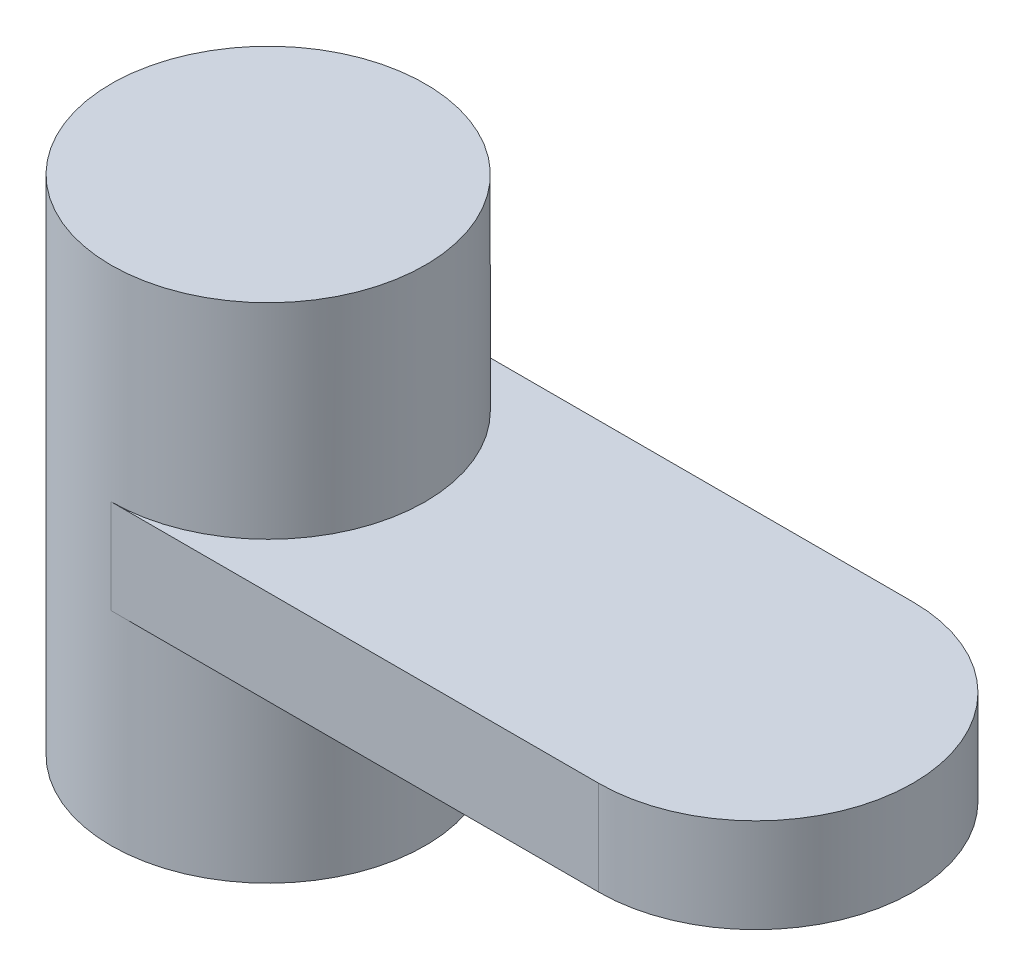
ISO-10303-21;
HEADER;
FILE_DESCRIPTION(('STEP AP214'),'2;1');
FILE_NAME('part.step','',(''),(''),'','','');
FILE_SCHEMA(('AUTOMOTIVE_DESIGN { 1 0 10303 214 1 1 1 1 }'));
ENDSEC;
DATA;
#1=APPLICATION_CONTEXT('core data for automotive mechanical design processes');
#2=APPLICATION_PROTOCOL_DEFINITION('international standard','automotive_design',2000,#1);
#3=PRODUCT_CONTEXT('',#1,'mechanical');
#4=PRODUCT('Part','Part','',(#3));
#5=PRODUCT_RELATED_PRODUCT_CATEGORY('part','',(#4));
#6=PRODUCT_DEFINITION_FORMATION('','',#4);
#7=PRODUCT_DEFINITION_CONTEXT('part definition',#1,'design');
#8=PRODUCT_DEFINITION('design','',#6,#7);
#9=PRODUCT_DEFINITION_SHAPE('','',#8);
#10=(LENGTH_UNIT() NAMED_UNIT(*) SI_UNIT(.MILLI.,.METRE.));
#11=(NAMED_UNIT(*) PLANE_ANGLE_UNIT() SI_UNIT($,.RADIAN.));
#12=(NAMED_UNIT(*) SI_UNIT($,.STERADIAN.) SOLID_ANGLE_UNIT());
#13=UNCERTAINTY_MEASURE_WITH_UNIT(LENGTH_MEASURE(1.E-05),#10,'distance_accuracy_value','');
#14=(GEOMETRIC_REPRESENTATION_CONTEXT(3) GLOBAL_UNCERTAINTY_ASSIGNED_CONTEXT((#13)) GLOBAL_UNIT_ASSIGNED_CONTEXT((#10,
#11,#12)) REPRESENTATION_CONTEXT('',''));
#15=CARTESIAN_POINT('',(0.,0.,0.));
#16=DIRECTION('',(0.,0.,1.));
#17=DIRECTION('',(1.,0.,0.));
#18=AXIS2_PLACEMENT_3D('',#15,#16,#17);
#19=CARTESIAN_POINT('',(49.276,19.05,0.));
#20=DIRECTION('',(0.,-1.,0.));
#21=DIRECTION('',(0.,0.,-1.));
#22=AXIS2_PLACEMENT_3D('',#19,#20,#21);
#23=CYLINDRICAL_SURFACE('',#22,31.75);
#24=CARTESIAN_POINT('',(49.276,0.,0.));
#25=DIRECTION('',(0.,1.,0.));
#26=DIRECTION('',(0.,0.,1.));
#27=AXIS2_PLACEMENT_3D('',#24,#25,#26);
#28=CIRCLE('',#27,31.75);
#29=CARTESIAN_POINT('',(49.276,0.,31.75));
#30=VERTEX_POINT('',#29);
#31=CARTESIAN_POINT('',(49.276,0.,-31.75));
#32=VERTEX_POINT('',#31);
#33=EDGE_CURVE('E92',#30,#32,#28,.T.);
#34=ORIENTED_EDGE('',*,*,#33,.T.);
#35=DIRECTION('',(0.,-1.,0.));
#36=VECTOR('',#35,1.);
#37=CARTESIAN_POINT('',(49.276,19.05,-31.75));
#38=LINE('',#37,#36);
#39=CARTESIAN_POINT('',(49.276,19.05,-31.75));
#40=VERTEX_POINT('',#39);
#41=EDGE_CURVE('E45',#40,#32,#38,.T.);
#42=ORIENTED_EDGE('',*,*,#41,.F.);
#43=CARTESIAN_POINT('',(49.276,19.05,0.));
#44=DIRECTION('',(0.,1.,0.));
#45=DIRECTION('',(0.,0.,1.));
#46=AXIS2_PLACEMENT_3D('',#43,#44,#45);
#47=CIRCLE('',#46,31.75);
#48=CARTESIAN_POINT('',(49.276,19.05,31.75));
#49=VERTEX_POINT('',#48);
#50=EDGE_CURVE('E103',#49,#40,#47,.T.);
#51=ORIENTED_EDGE('',*,*,#50,.F.);
#52=DIRECTION('',(0.,-1.,0.));
#53=VECTOR('',#52,1.);
#54=CARTESIAN_POINT('',(49.276,19.05,31.75));
#55=LINE('',#54,#53);
#56=EDGE_CURVE('E99',#49,#30,#55,.T.);
#57=ORIENTED_EDGE('',*,*,#56,.T.);
#58=EDGE_LOOP('',(#34,#42,#51,#57));
#59=FACE_BOUND('',#58,.T.);
#60=ADVANCED_FACE('F37',(#59),#23,.T.);
#61=CARTESIAN_POINT('',(-49.276,19.05,-31.75));
#62=DIRECTION('',(0.,0.,1.));
#63=DIRECTION('',(1.,0.,0.));
#64=AXIS2_PLACEMENT_3D('',#61,#62,#63);
#65=PLANE('',#64);
#66=DIRECTION('',(-1.,0.,0.));
#67=VECTOR('',#66,1.);
#68=CARTESIAN_POINT('',(-49.276,0.,-31.75));
#69=LINE('',#68,#67);
#70=CARTESIAN_POINT('',(-49.276,0.,-31.75));
#71=VERTEX_POINT('',#70);
#72=EDGE_CURVE('E86',#32,#71,#69,.T.);
#73=ORIENTED_EDGE('',*,*,#72,.T.);
#74=DIRECTION('',(0.,-1.,0.));
#75=VECTOR('',#74,1.);
#76=CARTESIAN_POINT('',(-49.276,19.05,-31.75));
#77=LINE('',#76,#75);
#78=CARTESIAN_POINT('',(-49.276,19.05,-31.75));
#79=VERTEX_POINT('',#78);
#80=EDGE_CURVE('E88',#79,#71,#77,.T.);
#81=ORIENTED_EDGE('',*,*,#80,.F.);
#82=DIRECTION('',(-1.,0.,0.));
#83=VECTOR('',#82,1.);
#84=CARTESIAN_POINT('',(-49.276,19.05,-31.75));
#85=LINE('',#84,#83);
#86=EDGE_CURVE('E78',#40,#79,#85,.T.);
#87=ORIENTED_EDGE('',*,*,#86,.F.);
#88=ORIENTED_EDGE('',*,*,#41,.T.);
#89=EDGE_LOOP('',(#73,#81,#87,#88));
#90=FACE_BOUND('',#89,.T.);
#91=ADVANCED_FACE('F87',(#90),#65,.F.);
#92=CARTESIAN_POINT('',(-49.276,19.05,0.));
#93=DIRECTION('',(0.,-1.,0.));
#94=DIRECTION('',(0.,0.,-1.));
#95=AXIS2_PLACEMENT_3D('',#92,#93,#94);
#96=CYLINDRICAL_SURFACE('',#95,31.75);
#97=ORIENTED_EDGE('',*,*,#80,.T.);
#98=CARTESIAN_POINT('',(-49.2759999999998,0.,0.));
#99=DIRECTION('',(0.,1.,0.));
#100=DIRECTION('',(0.,0.,1.));
#101=AXIS2_PLACEMENT_3D('',#98,#99,#100);
#102=CIRCLE('',#101,31.75);
#103=CARTESIAN_POINT('',(-49.276,0.,31.75));
#104=VERTEX_POINT('',#103);
#105=EDGE_CURVE('E11',#104,#71,#102,.T.);
#106=ORIENTED_EDGE('',*,*,#105,.F.);
#107=DIRECTION('',(0.,-1.,0.));
#108=VECTOR('',#107,1.);
#109=CARTESIAN_POINT('',(-49.276,19.05,31.75));
#110=LINE('',#109,#108);
#111=CARTESIAN_POINT('',(-49.2759999999998,19.05,31.75));
#112=VERTEX_POINT('',#111);
#113=EDGE_CURVE('E97',#112,#104,#110,.T.);
#114=ORIENTED_EDGE('',*,*,#113,.F.);
#115=CARTESIAN_POINT('',(-49.2759999999998,19.05,0.));
#116=DIRECTION('',(0.,1.,0.));
#117=DIRECTION('',(0.,0.,1.));
#118=AXIS2_PLACEMENT_3D('',#115,#116,#117);
#119=CIRCLE('',#118,31.75);
#120=EDGE_CURVE('E96',#112,#79,#119,.T.);
#121=ORIENTED_EDGE('',*,*,#120,.T.);
#122=EDGE_LOOP('',(#97,#106,#114,#121));
#123=FACE_BOUND('',#122,.T.);
#124=CARTESIAN_POINT('',(-49.2759999999998,-41.148,0.));
#125=DIRECTION('',(0.,1.,0.));
#126=DIRECTION('',(0.,0.,1.));
#127=AXIS2_PLACEMENT_3D('',#124,#125,#126);
#128=CIRCLE('',#127,31.75);
#129=CARTESIAN_POINT('',(-49.2759999999998,-41.148,31.75));
#130=VERTEX_POINT('',#129);
#131=EDGE_CURVE('E110',#130,#130,#128,.T.);
#132=ORIENTED_EDGE('',*,*,#131,.T.);
#133=EDGE_LOOP('',(#132));
#134=FACE_BOUND('',#133,.T.);
#135=CARTESIAN_POINT('',(-49.2759999999998,60.452,0.));
#136=DIRECTION('',(0.,1.,0.));
#137=DIRECTION('',(0.,0.,1.));
#138=AXIS2_PLACEMENT_3D('',#135,#136,#137);
#139=CIRCLE('',#138,31.75);
#140=CARTESIAN_POINT('',(-49.2759999999998,60.452,31.75));
#141=VERTEX_POINT('',#140);
#142=EDGE_CURVE('E113',#141,#141,#139,.T.);
#143=ORIENTED_EDGE('',*,*,#142,.F.);
#144=EDGE_LOOP('',(#143));
#145=FACE_BOUND('',#144,.T.);
#146=ADVANCED_FACE('F94',(#123,#134,#145),#96,.T.);
#147=CARTESIAN_POINT('',(-49.276,19.05,31.75));
#148=DIRECTION('',(0.,0.,-1.));
#149=DIRECTION('',(-1.,0.,0.));
#150=AXIS2_PLACEMENT_3D('',#147,#148,#149);
#151=PLANE('',#150);
#152=DIRECTION('',(1.,0.,0.));
#153=VECTOR('',#152,1.);
#154=CARTESIAN_POINT('',(-49.276,0.,31.75));
#155=LINE('',#154,#153);
#156=EDGE_CURVE('E72',#104,#30,#155,.T.);
#157=ORIENTED_EDGE('',*,*,#156,.T.);
#158=ORIENTED_EDGE('',*,*,#56,.F.);
#159=DIRECTION('',(1.,0.,0.));
#160=VECTOR('',#159,1.);
#161=CARTESIAN_POINT('',(-49.276,19.05,31.75));
#162=LINE('',#161,#160);
#163=EDGE_CURVE('E53',#112,#49,#162,.T.);
#164=ORIENTED_EDGE('',*,*,#163,.F.);
#165=ORIENTED_EDGE('',*,*,#113,.T.);
#166=EDGE_LOOP('',(#157,#158,#164,#165));
#167=FACE_BOUND('',#166,.T.);
#168=ADVANCED_FACE('F120',(#167),#151,.F.);
#169=CARTESIAN_POINT('',(49.276,19.05,0.));
#170=DIRECTION('',(0.,1.,0.));
#171=DIRECTION('',(0.,0.,1.));
#172=AXIS2_PLACEMENT_3D('',#169,#170,#171);
#173=PLANE('',#172);
#174=ORIENTED_EDGE('',*,*,#120,.F.);
#175=ORIENTED_EDGE('',*,*,#163,.T.);
#176=ORIENTED_EDGE('',*,*,#50,.T.);
#177=ORIENTED_EDGE('',*,*,#86,.T.);
#178=EDGE_LOOP('',(#174,#175,#176,#177));
#179=FACE_BOUND('',#178,.T.);
#180=ADVANCED_FACE('F126',(#179),#173,.T.);
#181=CARTESIAN_POINT('',(49.276,0.,0.));
#182=DIRECTION('',(0.,1.,0.));
#183=DIRECTION('',(0.,0.,1.));
#184=AXIS2_PLACEMENT_3D('',#181,#182,#183);
#185=PLANE('',#184);
#186=ORIENTED_EDGE('',*,*,#156,.F.);
#187=ORIENTED_EDGE('',*,*,#105,.T.);
#188=ORIENTED_EDGE('',*,*,#72,.F.);
#189=ORIENTED_EDGE('',*,*,#33,.F.);
#190=EDGE_LOOP('',(#186,#187,#188,#189));
#191=FACE_BOUND('',#190,.T.);
#192=ADVANCED_FACE('F84',(#191),#185,.F.);
#193=CARTESIAN_POINT('',(-49.2759999999998,-41.148,0.));
#194=DIRECTION('',(0.,1.,0.));
#195=DIRECTION('',(0.,0.,1.));
#196=AXIS2_PLACEMENT_3D('',#193,#194,#195);
#197=PLANE('',#196);
#198=ORIENTED_EDGE('',*,*,#131,.F.);
#199=EDGE_LOOP('',(#198));
#200=FACE_BOUND('',#199,.T.);
#201=ADVANCED_FACE('F138',(#200),#197,.F.);
#202=CARTESIAN_POINT('',(-49.2759999999998,60.452,0.));
#203=DIRECTION('',(0.,1.,0.));
#204=DIRECTION('',(0.,0.,1.));
#205=AXIS2_PLACEMENT_3D('',#202,#203,#204);
#206=PLANE('',#205);
#207=ORIENTED_EDGE('',*,*,#142,.T.);
#208=EDGE_LOOP('',(#207));
#209=FACE_BOUND('',#208,.T.);
#210=ADVANCED_FACE('F117',(#209),#206,.T.);
#211=CLOSED_SHELL('',(#60,#91,#146,#168,#180,#192,#201,#210));
#212=MANIFOLD_SOLID_BREP('B2',#211);
#213=ADVANCED_BREP_SHAPE_REPRESENTATION('',(#18,#212),#14);
#214=SHAPE_DEFINITION_REPRESENTATION(#9,#213);
ENDSEC;
END-ISO-10303-21;
